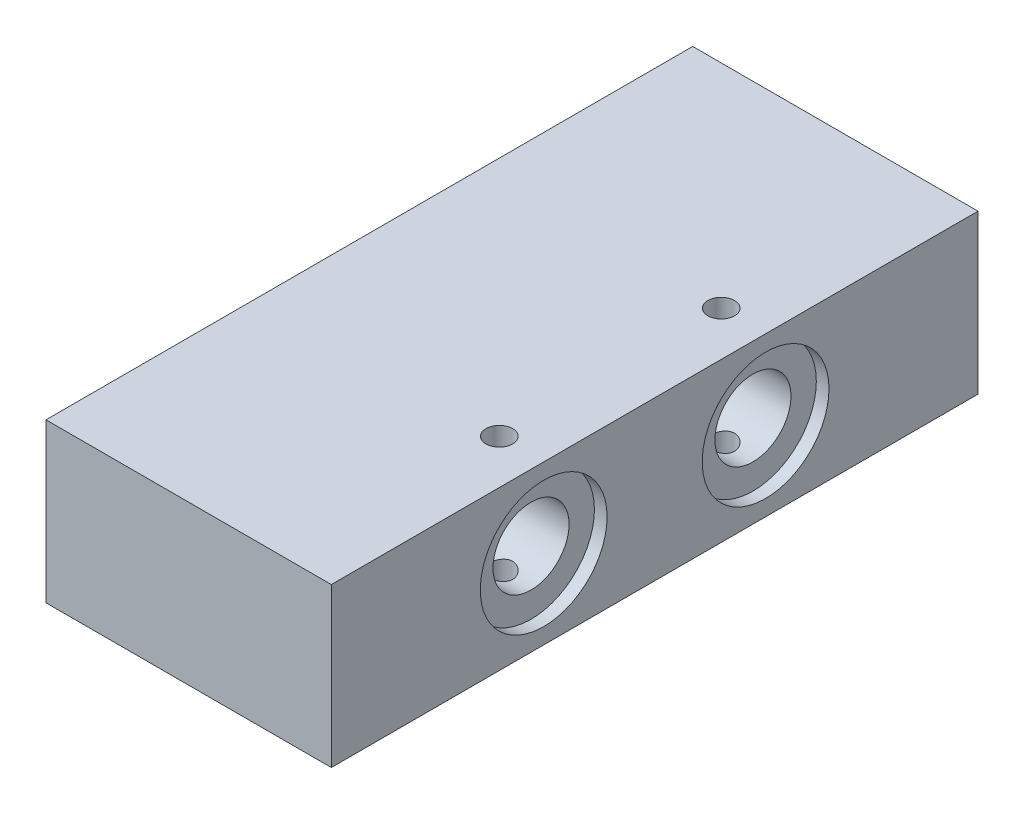
ISO-10303-21;
HEADER;
FILE_DESCRIPTION(('STEP AP214'),'2;1');
FILE_NAME('part.step','',(''),(''),'','','');
FILE_SCHEMA(('AUTOMOTIVE_DESIGN { 1 0 10303 214 1 1 1 1 }'));
ENDSEC;
DATA;
#1=APPLICATION_CONTEXT('core data for automotive mechanical design processes');
#2=APPLICATION_PROTOCOL_DEFINITION('international standard','automotive_design',2000,#1);
#3=PRODUCT_CONTEXT('',#1,'mechanical');
#4=PRODUCT('Part','Part','',(#3));
#5=PRODUCT_RELATED_PRODUCT_CATEGORY('part','',(#4));
#6=PRODUCT_DEFINITION_FORMATION('','',#4);
#7=PRODUCT_DEFINITION_CONTEXT('part definition',#1,'design');
#8=PRODUCT_DEFINITION('design','',#6,#7);
#9=PRODUCT_DEFINITION_SHAPE('','',#8);
#10=(LENGTH_UNIT() NAMED_UNIT(*) SI_UNIT(.MILLI.,.METRE.));
#11=(NAMED_UNIT(*) PLANE_ANGLE_UNIT() SI_UNIT($,.RADIAN.));
#12=(NAMED_UNIT(*) SI_UNIT($,.STERADIAN.) SOLID_ANGLE_UNIT());
#13=UNCERTAINTY_MEASURE_WITH_UNIT(LENGTH_MEASURE(1.E-05),#10,'distance_accuracy_value','');
#14=(GEOMETRIC_REPRESENTATION_CONTEXT(3) GLOBAL_UNCERTAINTY_ASSIGNED_CONTEXT((#13)) GLOBAL_UNIT_ASSIGNED_CONTEXT((#10,
#11,#12)) REPRESENTATION_CONTEXT('',''));
#15=CARTESIAN_POINT('',(0.,0.,0.));
#16=DIRECTION('',(0.,0.,1.));
#17=DIRECTION('',(1.,0.,0.));
#18=AXIS2_PLACEMENT_3D('',#15,#16,#17);
#19=CARTESIAN_POINT('',(51.5,12.5,-17.5));
#20=DIRECTION('',(-1.,0.,0.));
#21=DIRECTION('',(0.,0.,1.));
#22=AXIS2_PLACEMENT_3D('',#19,#20,#21);
#23=CYLINDRICAL_SURFACE('',#22,6.);
#24=CARTESIAN_POINT('',(-20.5,12.5,-17.5));
#25=DIRECTION('',(-1.,0.,0.));
#26=DIRECTION('',(0.,0.,1.));
#27=AXIS2_PLACEMENT_3D('',#24,#25,#26);
#28=CIRCLE('',#27,6.);
#29=CARTESIAN_POINT('',(-20.5,12.5,-11.5));
#30=VERTEX_POINT('',#29);
#31=EDGE_CURVE('E218',#30,#30,#28,.F.);
#32=ORIENTED_EDGE('',*,*,#31,.F.);
#33=EDGE_LOOP('',(#32));
#34=FACE_BOUND('',#33,.T.);
#35=CARTESIAN_POINT('',(15.5,6.87950180144144,-15.4));
#36=CARTESIAN_POINT('',(15.6140091370659,6.87950335416849,-15.3999981660795));
#37=CARTESIAN_POINT('',(15.7280054997691,6.87599503168696,-15.4093155658493));
#38=CARTESIAN_POINT('',(15.9525975361268,6.86242335244124,-15.4461965878829));
#39=CARTESIAN_POINT('',(16.0631929264259,6.85235945103352,-15.4737617261887));
#40=CARTESIAN_POINT('',(16.2776880101657,6.82695321430134,-15.5460324573795));
#41=CARTESIAN_POINT('',(16.381601386583,6.8116221018064,-15.5907016297407));
#42=CARTESIAN_POINT('',(16.5804960604428,6.77742586142541,-15.69578606891));
#43=CARTESIAN_POINT('',(16.6754750785458,6.75855983536296,-15.7562053391467));
#44=CARTESIAN_POINT('',(16.8579071700696,6.71850594504688,-15.8938702362096));
#45=CARTESIAN_POINT('',(16.9449187063024,6.69725602288834,-15.9716830748876));
#46=CARTESIAN_POINT('',(17.10496249642,6.65535047699435,-16.1407185024931));
#47=CARTESIAN_POINT('',(17.177992236625,6.63469496068866,-16.2319434974871));
#48=CARTESIAN_POINT('',(17.310050077352,6.59557966571241,-16.4284898883687));
#49=CARTESIAN_POINT('',(17.3686088540457,6.57720128059706,-16.5341442555558));
#50=CARTESIAN_POINT('',(17.4669437706491,6.54544783853445,-16.7545591394719));
#51=CARTESIAN_POINT('',(17.5067255278447,6.53207128550083,-16.8693169208311));
#52=CARTESIAN_POINT('',(17.5648601464858,6.512268593626,-17.1000466706463));
#53=CARTESIAN_POINT('',(17.5839708470312,6.50559733693646,-17.2158062571395));
#54=CARTESIAN_POINT('',(17.6026377051915,6.49908311029604,-17.4490686387137));
#55=CARTESIAN_POINT('',(17.602199408933,6.49923820368286,-17.5665709299256));
#56=CARTESIAN_POINT('',(17.5822462301927,6.50619701185992,-17.794593124822));
#57=CARTESIAN_POINT('',(17.5635559817971,6.51271331867675,-17.9051954286346));
#58=CARTESIAN_POINT('',(17.5090021832464,6.53129529585531,-18.1215810771555));
#59=CARTESIAN_POINT('',(17.4731374429334,6.54336135080119,-18.22736408734));
#60=CARTESIAN_POINT('',(17.3848104180733,6.57203678183691,-18.4328288990906));
#61=CARTESIAN_POINT('',(17.3321262487989,6.58870646852658,-18.532406550088));
#62=CARTESIAN_POINT('',(17.211843528005,6.62487245537467,-18.721540704408));
#63=CARTESIAN_POINT('',(17.1442405464951,6.64436959452568,-18.8110942192348));
#64=CARTESIAN_POINT('',(16.9919527118636,6.68533926038361,-18.9825279514394));
#65=CARTESIAN_POINT('',(16.9065667789838,6.70686180602603,-19.0637743670444));
#66=CARTESIAN_POINT('',(16.7232176097307,6.7486258207319,-19.2110132703147));
#67=CARTESIAN_POINT('',(16.6252520044331,6.7688670474309,-19.2770028783432));
#68=CARTESIAN_POINT('',(16.4173279585617,6.80606706045124,-19.3928569192318));
#69=CARTESIAN_POINT('',(16.307192826315,6.82296367852674,-19.4424257616536));
#70=CARTESIAN_POINT('',(16.0793951910192,6.85084427406937,-19.5220885446028));
#71=CARTESIAN_POINT('',(15.9617362639265,6.86183103738032,-19.5521916624246));
#72=CARTESIAN_POINT('',(15.7284219502318,6.87600736418172,-19.5907199837269));
#73=CARTESIAN_POINT('',(15.6129521614298,6.87955350700116,-19.6001376236113));
#74=CARTESIAN_POINT('',(15.3820525037002,6.87944898612691,-19.5998594060516));
#75=CARTESIAN_POINT('',(15.2666226314522,6.87579980772447,-19.5901674932892));
#76=CARTESIAN_POINT('',(15.0438091289816,6.86207398681584,-19.5528405037226));
#77=CARTESIAN_POINT('',(14.9362874798439,6.85225503930687,-19.525924056684));
#78=CARTESIAN_POINT('',(14.727318158626,6.82758816412807,-19.4557904123206));
#79=CARTESIAN_POINT('',(14.6258716349547,6.81273928913698,-19.4125701442093));
#80=CARTESIAN_POINT('',(14.4280943334976,6.77906028994252,-19.3093870929003));
#81=CARTESIAN_POINT('',(14.3320558829778,6.76011169196325,-19.2489037417046));
#82=CARTESIAN_POINT('',(14.1511349308617,6.72058587821707,-19.1134870037983));
#83=CARTESIAN_POINT('',(14.066256051002,6.70000813718104,-19.0385489453155));
#84=CARTESIAN_POINT('',(13.9053276287455,6.65820128584423,-18.8715594846913));
#85=CARTESIAN_POINT('',(13.8300006844134,6.63699685862056,-18.7788033309581));
#86=CARTESIAN_POINT('',(13.6959189184049,6.59740776303064,-18.5814435616735));
#87=CARTESIAN_POINT('',(13.6371637117127,6.57902302915819,-18.4768402214503));
#88=CARTESIAN_POINT('',(13.538387443467,6.54720718258133,-18.259129698059));
#89=CARTESIAN_POINT('',(13.4982621738044,6.53374860687456,-18.1460740272197));
#90=CARTESIAN_POINT('',(13.4377846514194,6.5131883790364,-17.9142488500416));
#91=CARTESIAN_POINT('',(13.4174244405947,6.50608416850659,-17.7954816635909));
#92=CARTESIAN_POINT('',(13.3978277524379,6.49924562159753,-17.5621821302514));
#93=CARTESIAN_POINT('',(13.3975585229167,6.49915096949631,-17.4477462191436));
#94=CARTESIAN_POINT('',(13.4155616577485,6.50543479747877,-17.2205349556428));
#95=CARTESIAN_POINT('',(13.4338322495852,6.51181265875197,-17.1077594455513));
#96=CARTESIAN_POINT('',(13.4876928151197,6.53017926099215,-16.8892218163541));
#97=CARTESIAN_POINT('',(13.5229471878998,6.54205911331472,-16.7833671643239));
#98=CARTESIAN_POINT('',(13.6094556259067,6.57020317095777,-16.5790455837162));
#99=CARTESIAN_POINT('',(13.6607126656733,6.5864681913067,-16.4805800328323));
#100=CARTESIAN_POINT('',(13.7800726297771,6.62251806982536,-16.2896196482028));
#101=CARTESIAN_POINT('',(13.848756728594,6.64241583855187,-16.1975097239615));
#102=CARTESIAN_POINT('',(14.0000615993759,6.68325566107431,-16.0257918633522));
#103=CARTESIAN_POINT('',(14.0826870416958,6.7041980631613,-15.9461881338785));
#104=CARTESIAN_POINT('',(14.2639022541288,6.74588527045598,-15.7981342176843));
#105=CARTESIAN_POINT('',(14.3630375996522,6.76658010223277,-15.7303354238279));
#106=CARTESIAN_POINT('',(14.5719486285899,6.8043218636563,-15.6123816880105));
#107=CARTESIAN_POINT('',(14.6817229325817,6.82136926530336,-15.5622244625783));
#108=CARTESIAN_POINT('',(14.9076825781629,6.84947477567238,-15.4817389953169));
#109=CARTESIAN_POINT('',(15.0237833759296,6.86059717380551,-15.4511971362794));
#110=CARTESIAN_POINT('',(15.2599286991957,6.87560824513645,-15.4103331440172));
#111=CARTESIAN_POINT('',(15.3799714290427,6.87950016673379,-15.4000019307475));
#112=CARTESIAN_POINT('',(15.5,6.87950180144144,-15.4));
#113=B_SPLINE_CURVE_WITH_KNOTS('',3,(#35,#36,#37,#38,#39,#40,#41,#42,#43,#44,#45,#46,#47,#48,
#49,#50,#51,#52,#53,#54,#55,#56,#57,#58,#59,#60,#61,#62,#63,#64,#65,#66,#67,#68,#69,#70,#71,#72,
#73,#74,#75,#76,#77,#78,#79,#80,#81,#82,#83,#84,#85,#86,#87,#88,#89,#90,#91,#92,#93,#94,#95,#96,
#97,#98,#99,#100,#101,#102,#103,#104,#105,#106,#107,#108,#109,#110,#111,#112),.UNSPECIFIED.,.T.,
.F.,(4,2,2,2,2,2,2,2,2,2,2,2,2,2,2,2,2,2,2,2,2,2,2,2,2,2,2,2,2,2,2,2,2,2,2,2,2,2,4),(0.,
0.341581962713038,0.683192307989642,1.02407925348461,1.36505293174606,1.71940579240763,
2.07382229975039,2.43855298376331,2.80317448659719,3.15392083853409,3.50456768299669,
3.84007194782349,4.17559946579063,4.51575014165978,4.85600195806706,5.21379905942499,
5.57166363794492,5.93565848344081,6.29948159486754,6.64542887028429,6.99130474115208,
7.32361553252674,7.65598894513419,7.99969400689681,8.34351034108724,8.70586039893278,
9.06820203750371,9.42849171734221,9.78863627174602,10.1302545747611,10.471840220127,
10.806936933281,11.1420959705822,11.4903822545165,11.8387854469785,12.2026433598833,
12.5664541587759,12.9262325794049,13.2858493250833),.UNSPECIFIED.);
#114=CARTESIAN_POINT('',(15.5,6.87950180144144,-15.4));
#115=VERTEX_POINT('',#114);
#116=EDGE_CURVE('E217',#115,#115,#113,.T.);
#117=ORIENTED_EDGE('',*,*,#116,.F.);
#118=EDGE_LOOP('',(#117));
#119=FACE_BOUND('',#118,.T.);
#120=CARTESIAN_POINT('',(15.5,18.1204981985586,-15.4));
#121=CARTESIAN_POINT('',(15.3859908629341,18.1204966458315,-15.3999981660795));
#122=CARTESIAN_POINT('',(15.2719945002309,18.124004968313,-15.4093155658493));
#123=CARTESIAN_POINT('',(15.0474024638732,18.1375766475588,-15.4461965878829));
#124=CARTESIAN_POINT('',(14.9368070735741,18.1476405489665,-15.4737617261887));
#125=CARTESIAN_POINT('',(14.7223119898343,18.1730467856987,-15.5460324573795));
#126=CARTESIAN_POINT('',(14.618398613417,18.1883778981936,-15.5907016297407));
#127=CARTESIAN_POINT('',(14.4195039395572,18.2225741385746,-15.69578606891));
#128=CARTESIAN_POINT('',(14.3245249214541,18.241440164637,-15.7562053391467));
#129=CARTESIAN_POINT('',(14.1420928299304,18.2814940549531,-15.8938702362096));
#130=CARTESIAN_POINT('',(14.0550812936976,18.3027439771117,-15.9716830748876));
#131=CARTESIAN_POINT('',(13.89503750358,18.3446495230056,-16.1407185024931));
#132=CARTESIAN_POINT('',(13.822007763375,18.3653050393113,-16.2319434974871));
#133=CARTESIAN_POINT('',(13.689949922648,18.4044203342876,-16.4284898883687));
#134=CARTESIAN_POINT('',(13.6313911459543,18.4227987194029,-16.5341442555558));
#135=CARTESIAN_POINT('',(13.5330562293509,18.4545521614656,-16.7545591394719));
#136=CARTESIAN_POINT('',(13.4932744721553,18.4679287144992,-16.8693169208311));
#137=CARTESIAN_POINT('',(13.4351398535142,18.487731406374,-17.1000466706463));
#138=CARTESIAN_POINT('',(13.4160291529688,18.4944026630635,-17.2158062571395));
#139=CARTESIAN_POINT('',(13.3973622948085,18.500916889704,-17.4490686387137));
#140=CARTESIAN_POINT('',(13.397800591067,18.5007617963171,-17.5665709299256));
#141=CARTESIAN_POINT('',(13.4177537698073,18.4938029881401,-17.794593124822));
#142=CARTESIAN_POINT('',(13.4364440182029,18.4872866813233,-17.9051954286346));
#143=CARTESIAN_POINT('',(13.4909978167536,18.4687047041447,-18.1215810771555));
#144=CARTESIAN_POINT('',(13.5268625570666,18.4566386491988,-18.22736408734));
#145=CARTESIAN_POINT('',(13.6151895819266,18.4279632181631,-18.4328288990906));
#146=CARTESIAN_POINT('',(13.6678737512011,18.4112935314734,-18.532406550088));
#147=CARTESIAN_POINT('',(13.788156471995,18.3751275446253,-18.721540704408));
#148=CARTESIAN_POINT('',(13.8557594535049,18.3556304054743,-18.8110942192348));
#149=CARTESIAN_POINT('',(14.0080472881364,18.3146607396164,-18.9825279514394));
#150=CARTESIAN_POINT('',(14.0934332210161,18.293138193974,-19.0637743670445));
#151=CARTESIAN_POINT('',(14.2767823902693,18.2513741792681,-19.2110132703147));
#152=CARTESIAN_POINT('',(14.3747479955669,18.2311329525691,-19.2770028783432));
#153=CARTESIAN_POINT('',(14.5826720414383,18.1939329395488,-19.3928569192318));
#154=CARTESIAN_POINT('',(14.692807173685,18.1770363214733,-19.4424257616536));
#155=CARTESIAN_POINT('',(14.9206048089808,18.1491557259306,-19.5220885446028));
#156=CARTESIAN_POINT('',(15.0382637360735,18.1381689626197,-19.5521916624246));
#157=CARTESIAN_POINT('',(15.2715780497682,18.1239926358183,-19.5907199837269));
#158=CARTESIAN_POINT('',(15.3870478385702,18.1204464929988,-19.6001376236113));
#159=CARTESIAN_POINT('',(15.6179474962998,18.1205510138731,-19.5998594060516));
#160=CARTESIAN_POINT('',(15.7333773685477,18.1242001922755,-19.5901674932892));
#161=CARTESIAN_POINT('',(15.9561908710184,18.1379260131842,-19.5528405037226));
#162=CARTESIAN_POINT('',(16.0637125201561,18.1477449606931,-19.525924056684));
#163=CARTESIAN_POINT('',(16.272681841374,18.1724118358719,-19.4557904123206));
#164=CARTESIAN_POINT('',(16.3741283650453,18.187260710863,-19.4125701442093));
#165=CARTESIAN_POINT('',(16.5719056665024,18.2209397100575,-19.3093870929003));
#166=CARTESIAN_POINT('',(16.6679441170222,18.2398883080368,-19.2489037417047));
#167=CARTESIAN_POINT('',(16.8488650691383,18.2794141217829,-19.1134870037983));
#168=CARTESIAN_POINT('',(16.933743948998,18.299991862819,-19.0385489453155));
#169=CARTESIAN_POINT('',(17.0946723712545,18.3417987141558,-18.8715594846913));
#170=CARTESIAN_POINT('',(17.1699993155866,18.3630031413794,-18.7788033309581));
#171=CARTESIAN_POINT('',(17.3040810815951,18.4025922369694,-18.5814435616735));
#172=CARTESIAN_POINT('',(17.3628362882873,18.4209769708418,-18.4768402214503));
#173=CARTESIAN_POINT('',(17.461612556533,18.4527928174187,-18.259129698059));
#174=CARTESIAN_POINT('',(17.5017378261956,18.4662513931254,-18.1460740272197));
#175=CARTESIAN_POINT('',(17.5622153485806,18.4868116209636,-17.9142488500416));
#176=CARTESIAN_POINT('',(17.5825755594053,18.4939158314934,-17.795481663591));
#177=CARTESIAN_POINT('',(17.6021722475621,18.5007543784025,-17.5621821302514));
#178=CARTESIAN_POINT('',(17.6024414770833,18.5008490305037,-17.4477462191436));
#179=CARTESIAN_POINT('',(17.5844383422515,18.4945652025212,-17.2205349556428));
#180=CARTESIAN_POINT('',(17.5661677504148,18.488187341248,-17.1077594455513));
#181=CARTESIAN_POINT('',(17.5123071848803,18.4698207390079,-16.8892218163541));
#182=CARTESIAN_POINT('',(17.4770528121002,18.4579408866853,-16.7833671643239));
#183=CARTESIAN_POINT('',(17.3905443740933,18.4297968290422,-16.5790455837162));
#184=CARTESIAN_POINT('',(17.3392873343267,18.4135318086933,-16.4805800328323));
#185=CARTESIAN_POINT('',(17.2199273702229,18.3774819301746,-16.2896196482028));
#186=CARTESIAN_POINT('',(17.1512432714059,18.3575841614481,-16.1975097239615));
#187=CARTESIAN_POINT('',(16.9999384006241,18.3167443389257,-16.0257918633522));
#188=CARTESIAN_POINT('',(16.9173129583042,18.2958019368387,-15.9461881338785));
#189=CARTESIAN_POINT('',(16.7360977458712,18.254114729544,-15.7981342176843));
#190=CARTESIAN_POINT('',(16.6369624003478,18.2334198977672,-15.7303354238279));
#191=CARTESIAN_POINT('',(16.4280513714101,18.1956781363437,-15.6123816880105));
#192=CARTESIAN_POINT('',(16.3182770674183,18.1786307346966,-15.5622244625783));
#193=CARTESIAN_POINT('',(16.0923174218371,18.1505252243276,-15.4817389953169));
#194=CARTESIAN_POINT('',(15.9762166240704,18.1394028261945,-15.4511971362794));
#195=CARTESIAN_POINT('',(15.7400713008043,18.1243917548636,-15.4103331440172));
#196=CARTESIAN_POINT('',(15.6200285709573,18.1204998332662,-15.4000019307475));
#197=CARTESIAN_POINT('',(15.5,18.1204981985586,-15.4));
#198=B_SPLINE_CURVE_WITH_KNOTS('',3,(#120,#121,#122,#123,#124,#125,#126,#127,#128,#129,#130,
#131,#132,#133,#134,#135,#136,#137,#138,#139,#140,#141,#142,#143,#144,#145,#146,#147,#148,#149,
#150,#151,#152,#153,#154,#155,#156,#157,#158,#159,#160,#161,#162,#163,#164,#165,#166,#167,#168,
#169,#170,#171,#172,#173,#174,#175,#176,#177,#178,#179,#180,#181,#182,#183,#184,#185,#186,#187,
#188,#189,#190,#191,#192,#193,#194,#195,#196,#197),.UNSPECIFIED.,.T.,.F.,(4,2,2,2,2,2,2,2,2,2,2,
2,2,2,2,2,2,2,2,2,2,2,2,2,2,2,2,2,2,2,2,2,2,2,2,2,2,2,4),(0.,0.341581962713036,
0.683192307989641,1.02407925348461,1.36505293174606,1.71940579240762,2.07382229975038,
2.43855298376331,2.80317448659718,3.15392083853409,3.50456768299669,3.84007194782349,
4.17559946579063,4.51575014165978,4.85600195806706,5.21379905942499,5.57166363794492,
5.93565848344081,6.29948159486754,6.64542887028429,6.99130474115207,7.32361553252674,
7.65598894513419,7.9996940068968,8.34351034108723,8.70586039893278,9.0682020375037,
9.4284917173422,9.78863627174602,10.1302545747611,10.471840220127,10.806936933281,
11.1420959705822,11.4903822545165,11.8387854469784,12.2026433598833,12.5664541587759,
12.9262325794049,13.2858493250833),.UNSPECIFIED.);
#199=CARTESIAN_POINT('',(15.5,18.1204981985586,-15.4));
#200=VERTEX_POINT('',#199);
#201=EDGE_CURVE('E208',#200,#200,#198,.T.);
#202=ORIENTED_EDGE('',*,*,#201,.F.);
#203=EDGE_LOOP('',(#202));
#204=FACE_BOUND('',#203,.T.);
#205=CARTESIAN_POINT('',(20.5,12.5,-17.5));
#206=DIRECTION('',(1.,0.,0.));
#207=DIRECTION('',(0.,0.,-1.));
#208=AXIS2_PLACEMENT_3D('',#205,#206,#207);
#209=CIRCLE('',#208,6.);
#210=CARTESIAN_POINT('',(20.5,12.5,-23.5));
#211=VERTEX_POINT('',#210);
#212=EDGE_CURVE('E49',#211,#211,#209,.F.);
#213=ORIENTED_EDGE('',*,*,#212,.F.);
#214=EDGE_LOOP('',(#213));
#215=FACE_BOUND('',#214,.T.);
#216=ADVANCED_FACE('F45',(#34,#119,#204,#215),#23,.F.);
#217=CARTESIAN_POINT('',(51.5,12.5,17.5));
#218=DIRECTION('',(-1.,0.,0.));
#219=DIRECTION('',(0.,0.,1.));
#220=AXIS2_PLACEMENT_3D('',#217,#218,#219);
#221=CYLINDRICAL_SURFACE('',#220,6.);
#222=CARTESIAN_POINT('',(-20.5,12.5,17.5));
#223=DIRECTION('',(-1.,0.,0.));
#224=DIRECTION('',(0.,0.,1.));
#225=AXIS2_PLACEMENT_3D('',#222,#223,#224);
#226=CIRCLE('',#225,6.);
#227=CARTESIAN_POINT('',(-20.5,12.5,23.5));
#228=VERTEX_POINT('',#227);
#229=EDGE_CURVE('E149',#228,#228,#226,.F.);
#230=ORIENTED_EDGE('',*,*,#229,.F.);
#231=EDGE_LOOP('',(#230));
#232=FACE_BOUND('',#231,.T.);
#233=CARTESIAN_POINT('',(15.5,6.87950180144144,19.6));
#234=CARTESIAN_POINT('',(15.6140091370659,6.87950335416849,19.6000018339205));
#235=CARTESIAN_POINT('',(15.7280054997691,6.87599503168696,19.5906844341507));
#236=CARTESIAN_POINT('',(15.9525975361268,6.86242335244124,19.5538034121171));
#237=CARTESIAN_POINT('',(16.0631929264259,6.85235945103352,19.5262382738113));
#238=CARTESIAN_POINT('',(16.2776880101657,6.82695321430134,19.4539675426205));
#239=CARTESIAN_POINT('',(16.381601386583,6.8116221018064,19.4092983702593));
#240=CARTESIAN_POINT('',(16.5804960604428,6.77742586142541,19.30421393109));
#241=CARTESIAN_POINT('',(16.6754750785458,6.75855983536295,19.2437946608533));
#242=CARTESIAN_POINT('',(16.8579071700696,6.71850594504688,19.1061297637904));
#243=CARTESIAN_POINT('',(16.9449187063024,6.69725602288834,19.0283169251124));
#244=CARTESIAN_POINT('',(17.10496249642,6.65535047699435,18.8592814975069));
#245=CARTESIAN_POINT('',(17.177992236625,6.63469496068866,18.7680565025129));
#246=CARTESIAN_POINT('',(17.310050077352,6.59557966571241,18.5715101116313));
#247=CARTESIAN_POINT('',(17.3686088540457,6.57720128059706,18.4658557444442));
#248=CARTESIAN_POINT('',(17.4669437706491,6.54544783853445,18.2454408605281));
#249=CARTESIAN_POINT('',(17.5067255278447,6.53207128550083,18.1306830791689));
#250=CARTESIAN_POINT('',(17.5648601464858,6.512268593626,17.8999533293537));
#251=CARTESIAN_POINT('',(17.5839708470312,6.50559733693646,17.7841937428605));
#252=CARTESIAN_POINT('',(17.6026377051915,6.49908311029604,17.5509313612863));
#253=CARTESIAN_POINT('',(17.602199408933,6.49923820368286,17.4334290700744));
#254=CARTESIAN_POINT('',(17.5822462301927,6.50619701185992,17.205406875178));
#255=CARTESIAN_POINT('',(17.5635559817971,6.51271331867675,17.0948045713654));
#256=CARTESIAN_POINT('',(17.5090021832464,6.53129529585531,16.8784189228445));
#257=CARTESIAN_POINT('',(17.4731374429334,6.54336135080119,16.77263591266));
#258=CARTESIAN_POINT('',(17.3848104180733,6.57203678183691,16.5671711009094));
#259=CARTESIAN_POINT('',(17.3321262487989,6.58870646852658,16.467593449912));
#260=CARTESIAN_POINT('',(17.211843528005,6.62487245537467,16.278459295592));
#261=CARTESIAN_POINT('',(17.1442405464951,6.64436959452568,16.1889057807652));
#262=CARTESIAN_POINT('',(16.9919527118636,6.68533926038361,16.0174720485606));
#263=CARTESIAN_POINT('',(16.9065667789838,6.70686180602603,15.9362256329556));
#264=CARTESIAN_POINT('',(16.7232176097307,6.7486258207319,15.7889867296853));
#265=CARTESIAN_POINT('',(16.6252520044331,6.7688670474309,15.7229971216568));
#266=CARTESIAN_POINT('',(16.4173279585617,6.80606706045124,15.6071430807682));
#267=CARTESIAN_POINT('',(16.307192826315,6.82296367852674,15.5575742383464));
#268=CARTESIAN_POINT('',(16.0793951910192,6.85084427406937,15.4779114553972));
#269=CARTESIAN_POINT('',(15.9617362639265,6.86183103738032,15.4478083375754));
#270=CARTESIAN_POINT('',(15.7284219502318,6.87600736418172,15.4092800162731));
#271=CARTESIAN_POINT('',(15.6129521614298,6.87955350700116,15.3998623763887));
#272=CARTESIAN_POINT('',(15.3820525037002,6.87944898612692,15.4001405939484));
#273=CARTESIAN_POINT('',(15.2666226314522,6.87579980772447,15.4098325067108));
#274=CARTESIAN_POINT('',(15.0438091289816,6.86207398681584,15.4471594962774));
#275=CARTESIAN_POINT('',(14.9362874798439,6.85225503930687,15.474075943316));
#276=CARTESIAN_POINT('',(14.727318158626,6.82758816412807,15.5442095876794));
#277=CARTESIAN_POINT('',(14.6258716349547,6.81273928913698,15.5874298557907));
#278=CARTESIAN_POINT('',(14.4280943334976,6.77906028994252,15.6906129070997));
#279=CARTESIAN_POINT('',(14.3320558829778,6.76011169196325,15.7510962582954));
#280=CARTESIAN_POINT('',(14.1511349308617,6.72058587821707,15.8865129962017));
#281=CARTESIAN_POINT('',(14.066256051002,6.70000813718104,15.9614510546845));
#282=CARTESIAN_POINT('',(13.9053276287455,6.65820128584423,16.1284405153087));
#283=CARTESIAN_POINT('',(13.8300006844134,6.63699685862056,16.2211966690419));
#284=CARTESIAN_POINT('',(13.6959189184049,6.59740776303064,16.4185564383265));
#285=CARTESIAN_POINT('',(13.6371637117127,6.57902302915819,16.5231597785497));
#286=CARTESIAN_POINT('',(13.538387443467,6.54720718258133,16.740870301941));
#287=CARTESIAN_POINT('',(13.4982621738044,6.53374860687456,16.8539259727803));
#288=CARTESIAN_POINT('',(13.4377846514194,6.5131883790364,17.0857511499584));
#289=CARTESIAN_POINT('',(13.4174244405947,6.50608416850659,17.2045183364091));
#290=CARTESIAN_POINT('',(13.3978277524379,6.49924562159753,17.4378178697486));
#291=CARTESIAN_POINT('',(13.3975585229167,6.49915096949631,17.5522537808564));
#292=CARTESIAN_POINT('',(13.4155616577485,6.50543479747877,17.7794650443572));
#293=CARTESIAN_POINT('',(13.4338322495852,6.51181265875197,17.8922405544487));
#294=CARTESIAN_POINT('',(13.4876928151197,6.53017926099215,18.1107781836459));
#295=CARTESIAN_POINT('',(13.5229471878998,6.54205911331472,18.2166328356761));
#296=CARTESIAN_POINT('',(13.6094556259067,6.57020317095777,18.4209544162838));
#297=CARTESIAN_POINT('',(13.6607126656733,6.5864681913067,18.5194199671677));
#298=CARTESIAN_POINT('',(13.7800726297771,6.62251806982536,18.7103803517972));
#299=CARTESIAN_POINT('',(13.848756728594,6.64241583855187,18.8024902760385));
#300=CARTESIAN_POINT('',(14.0000615993759,6.68325566107431,18.9742081366478));
#301=CARTESIAN_POINT('',(14.0826870416958,6.7041980631613,19.0538118661215));
#302=CARTESIAN_POINT('',(14.2639022541288,6.74588527045598,19.2018657823157));
#303=CARTESIAN_POINT('',(14.3630375996522,6.76658010223277,19.2696645761721));
#304=CARTESIAN_POINT('',(14.5719486285899,6.8043218636563,19.3876183119895));
#305=CARTESIAN_POINT('',(14.6817229325817,6.82136926530336,19.4377755374217));
#306=CARTESIAN_POINT('',(14.9076825781629,6.84947477567238,19.5182610046831));
#307=CARTESIAN_POINT('',(15.0237833759296,6.86059717380551,19.5488028637206));
#308=CARTESIAN_POINT('',(15.2599286991957,6.87560824513645,19.5896668559828));
#309=CARTESIAN_POINT('',(15.3799714290427,6.87950016673379,19.5999980692525));
#310=CARTESIAN_POINT('',(15.5,6.87950180144144,19.6));
#311=B_SPLINE_CURVE_WITH_KNOTS('',3,(#233,#234,#235,#236,#237,#238,#239,#240,#241,#242,#243,
#244,#245,#246,#247,#248,#249,#250,#251,#252,#253,#254,#255,#256,#257,#258,#259,#260,#261,#262,
#263,#264,#265,#266,#267,#268,#269,#270,#271,#272,#273,#274,#275,#276,#277,#278,#279,#280,#281,
#282,#283,#284,#285,#286,#287,#288,#289,#290,#291,#292,#293,#294,#295,#296,#297,#298,#299,#300,
#301,#302,#303,#304,#305,#306,#307,#308,#309,#310),.UNSPECIFIED.,.T.,.F.,(4,2,2,2,2,2,2,2,2,2,2,
2,2,2,2,2,2,2,2,2,2,2,2,2,2,2,2,2,2,2,2,2,2,2,2,2,2,2,4),(0.,0.341581962713038,
0.683192307989642,1.02407925348462,1.36505293174606,1.71940579240763,2.07382229975039,
2.43855298376331,2.80317448659719,3.15392083853409,3.50456768299669,3.8400719478235,
4.17559946579063,4.51575014165978,4.85600195806706,5.21379905942499,5.57166363794492,
5.93565848344082,6.29948159486754,6.64542887028429,6.99130474115208,7.32361553252674,
7.65598894513419,7.9996940068968,8.34351034108724,8.70586039893278,9.06820203750371,
9.42849171734221,9.78863627174602,10.1302545747611,10.471840220127,10.806936933281,
11.1420959705822,11.4903822545165,11.8387854469785,12.2026433598833,12.5664541587759,
12.9262325794049,13.2858493250833),.UNSPECIFIED.);
#312=CARTESIAN_POINT('',(15.5,6.87950180144144,19.6));
#313=VERTEX_POINT('',#312);
#314=EDGE_CURVE('E167',#313,#313,#311,.T.);
#315=ORIENTED_EDGE('',*,*,#314,.F.);
#316=EDGE_LOOP('',(#315));
#317=FACE_BOUND('',#316,.T.);
#318=CARTESIAN_POINT('',(15.5,18.1204981985586,19.6));
#319=CARTESIAN_POINT('',(15.3859908629341,18.1204966458315,19.6000018339205));
#320=CARTESIAN_POINT('',(15.2719945002309,18.124004968313,19.5906844341507));
#321=CARTESIAN_POINT('',(15.0474024638732,18.1375766475588,19.5538034121171));
#322=CARTESIAN_POINT('',(14.9368070735741,18.1476405489665,19.5262382738113));
#323=CARTESIAN_POINT('',(14.7223119898343,18.1730467856987,19.4539675426205));
#324=CARTESIAN_POINT('',(14.618398613417,18.1883778981936,19.4092983702593));
#325=CARTESIAN_POINT('',(14.4195039395572,18.2225741385746,19.30421393109));
#326=CARTESIAN_POINT('',(14.3245249214541,18.241440164637,19.2437946608533));
#327=CARTESIAN_POINT('',(14.1420928299304,18.2814940549531,19.1061297637904));
#328=CARTESIAN_POINT('',(14.0550812936976,18.3027439771117,19.0283169251124));
#329=CARTESIAN_POINT('',(13.89503750358,18.3446495230056,18.8592814975069));
#330=CARTESIAN_POINT('',(13.822007763375,18.3653050393113,18.7680565025129));
#331=CARTESIAN_POINT('',(13.689949922648,18.4044203342876,18.5715101116313));
#332=CARTESIAN_POINT('',(13.6313911459543,18.4227987194029,18.4658557444442));
#333=CARTESIAN_POINT('',(13.5330562293509,18.4545521614656,18.2454408605281));
#334=CARTESIAN_POINT('',(13.4932744721553,18.4679287144992,18.1306830791689));
#335=CARTESIAN_POINT('',(13.4351398535142,18.487731406374,17.8999533293537));
#336=CARTESIAN_POINT('',(13.4160291529688,18.4944026630635,17.7841937428605));
#337=CARTESIAN_POINT('',(13.3973622948085,18.500916889704,17.5509313612863));
#338=CARTESIAN_POINT('',(13.397800591067,18.5007617963171,17.4334290700744));
#339=CARTESIAN_POINT('',(13.4177537698073,18.4938029881401,17.205406875178));
#340=CARTESIAN_POINT('',(13.4364440182029,18.4872866813233,17.0948045713654));
#341=CARTESIAN_POINT('',(13.4909978167536,18.4687047041447,16.8784189228445));
#342=CARTESIAN_POINT('',(13.5268625570666,18.4566386491988,16.77263591266));
#343=CARTESIAN_POINT('',(13.6151895819266,18.4279632181631,16.5671711009094));
#344=CARTESIAN_POINT('',(13.6678737512011,18.4112935314734,16.467593449912));
#345=CARTESIAN_POINT('',(13.788156471995,18.3751275446253,16.278459295592));
#346=CARTESIAN_POINT('',(13.8557594535049,18.3556304054743,16.1889057807652));
#347=CARTESIAN_POINT('',(14.0080472881364,18.3146607396164,16.0174720485606));
#348=CARTESIAN_POINT('',(14.0934332210161,18.293138193974,15.9362256329556));
#349=CARTESIAN_POINT('',(14.2767823902693,18.2513741792681,15.7889867296853));
#350=CARTESIAN_POINT('',(14.3747479955669,18.2311329525691,15.7229971216568));
#351=CARTESIAN_POINT('',(14.5826720414383,18.1939329395488,15.6071430807682));
#352=CARTESIAN_POINT('',(14.692807173685,18.1770363214733,15.5575742383464));
#353=CARTESIAN_POINT('',(14.9206048089808,18.1491557259306,15.4779114553972));
#354=CARTESIAN_POINT('',(15.0382637360735,18.1381689626197,15.4478083375754));
#355=CARTESIAN_POINT('',(15.2715780497682,18.1239926358183,15.4092800162731));
#356=CARTESIAN_POINT('',(15.3870478385702,18.1204464929988,15.3998623763887));
#357=CARTESIAN_POINT('',(15.6179474962998,18.1205510138731,15.4001405939484));
#358=CARTESIAN_POINT('',(15.7333773685477,18.1242001922755,15.4098325067108));
#359=CARTESIAN_POINT('',(15.9561908710184,18.1379260131842,15.4471594962774));
#360=CARTESIAN_POINT('',(16.0637125201561,18.1477449606931,15.474075943316));
#361=CARTESIAN_POINT('',(16.272681841374,18.1724118358719,15.5442095876794));
#362=CARTESIAN_POINT('',(16.3741283650453,18.187260710863,15.5874298557907));
#363=CARTESIAN_POINT('',(16.5719056665024,18.2209397100575,15.6906129070997));
#364=CARTESIAN_POINT('',(16.6679441170222,18.2398883080368,15.7510962582954));
#365=CARTESIAN_POINT('',(16.8488650691383,18.2794141217829,15.8865129962017));
#366=CARTESIAN_POINT('',(16.933743948998,18.299991862819,15.9614510546845));
#367=CARTESIAN_POINT('',(17.0946723712545,18.3417987141558,16.1284405153087));
#368=CARTESIAN_POINT('',(17.1699993155866,18.3630031413794,16.2211966690419));
#369=CARTESIAN_POINT('',(17.3040810815951,18.4025922369694,16.4185564383265));
#370=CARTESIAN_POINT('',(17.3628362882873,18.4209769708418,16.5231597785497));
#371=CARTESIAN_POINT('',(17.461612556533,18.4527928174187,16.740870301941));
#372=CARTESIAN_POINT('',(17.5017378261956,18.4662513931254,16.8539259727803));
#373=CARTESIAN_POINT('',(17.5622153485806,18.4868116209636,17.0857511499584));
#374=CARTESIAN_POINT('',(17.5825755594053,18.4939158314934,17.2045183364091));
#375=CARTESIAN_POINT('',(17.6021722475621,18.5007543784025,17.4378178697486));
#376=CARTESIAN_POINT('',(17.6024414770833,18.5008490305037,17.5522537808564));
#377=CARTESIAN_POINT('',(17.5844383422515,18.4945652025212,17.7794650443572));
#378=CARTESIAN_POINT('',(17.5661677504148,18.488187341248,17.8922405544487));
#379=CARTESIAN_POINT('',(17.5123071848803,18.4698207390079,18.1107781836459));
#380=CARTESIAN_POINT('',(17.4770528121002,18.4579408866853,18.2166328356762));
#381=CARTESIAN_POINT('',(17.3905443740933,18.4297968290422,18.4209544162838));
#382=CARTESIAN_POINT('',(17.3392873343267,18.4135318086933,18.5194199671677));
#383=CARTESIAN_POINT('',(17.2199273702229,18.3774819301746,18.7103803517972));
#384=CARTESIAN_POINT('',(17.1512432714059,18.3575841614481,18.8024902760385));
#385=CARTESIAN_POINT('',(16.9999384006241,18.3167443389257,18.9742081366478));
#386=CARTESIAN_POINT('',(16.9173129583042,18.2958019368387,19.0538118661215));
#387=CARTESIAN_POINT('',(16.7360977458712,18.254114729544,19.2018657823157));
#388=CARTESIAN_POINT('',(16.6369624003478,18.2334198977672,19.2696645761721));
#389=CARTESIAN_POINT('',(16.4280513714101,18.1956781363437,19.3876183119895));
#390=CARTESIAN_POINT('',(16.3182770674183,18.1786307346966,19.4377755374217));
#391=CARTESIAN_POINT('',(16.0923174218371,18.1505252243276,19.5182610046831));
#392=CARTESIAN_POINT('',(15.9762166240704,18.1394028261945,19.5488028637206));
#393=CARTESIAN_POINT('',(15.7400713008043,18.1243917548636,19.5896668559828));
#394=CARTESIAN_POINT('',(15.6200285709573,18.1204998332662,19.5999980692525));
#395=CARTESIAN_POINT('',(15.5,18.1204981985586,19.6));
#396=B_SPLINE_CURVE_WITH_KNOTS('',3,(#318,#319,#320,#321,#322,#323,#324,#325,#326,#327,#328,
#329,#330,#331,#332,#333,#334,#335,#336,#337,#338,#339,#340,#341,#342,#343,#344,#345,#346,#347,
#348,#349,#350,#351,#352,#353,#354,#355,#356,#357,#358,#359,#360,#361,#362,#363,#364,#365,#366,
#367,#368,#369,#370,#371,#372,#373,#374,#375,#376,#377,#378,#379,#380,#381,#382,#383,#384,#385,
#386,#387,#388,#389,#390,#391,#392,#393,#394,#395),.UNSPECIFIED.,.T.,.F.,(4,2,2,2,2,2,2,2,2,2,2,
2,2,2,2,2,2,2,2,2,2,2,2,2,2,2,2,2,2,2,2,2,2,2,2,2,2,2,4),(0.,0.341581962713036,
0.683192307989641,1.02407925348461,1.36505293174606,1.71940579240762,2.07382229975038,
2.43855298376331,2.80317448659718,3.15392083853409,3.50456768299669,3.8400719478235,
4.17559946579063,4.51575014165978,4.85600195806706,5.21379905942499,5.57166363794492,
5.93565848344081,6.29948159486754,6.64542887028429,6.99130474115207,7.32361553252674,
7.65598894513419,7.9996940068968,8.34351034108723,8.70586039893277,9.0682020375037,
9.4284917173422,9.78863627174602,10.1302545747611,10.471840220127,10.806936933281,
11.1420959705822,11.4903822545165,11.8387854469785,12.2026433598833,12.5664541587759,
12.9262325794049,13.2858493250833),.UNSPECIFIED.);
#397=CARTESIAN_POINT('',(15.5,18.1204981985586,19.6));
#398=VERTEX_POINT('',#397);
#399=EDGE_CURVE('E240',#398,#398,#396,.T.);
#400=ORIENTED_EDGE('',*,*,#399,.F.);
#401=EDGE_LOOP('',(#400));
#402=FACE_BOUND('',#401,.T.);
#403=CARTESIAN_POINT('',(20.5,12.5,17.5));
#404=DIRECTION('',(1.,0.,0.));
#405=DIRECTION('',(0.,0.,-1.));
#406=AXIS2_PLACEMENT_3D('',#403,#404,#405);
#407=CIRCLE('',#406,6.);
#408=CARTESIAN_POINT('',(20.5,12.5,11.5));
#409=VERTEX_POINT('',#408);
#410=EDGE_CURVE('E133',#409,#409,#407,.F.);
#411=ORIENTED_EDGE('',*,*,#410,.F.);
#412=EDGE_LOOP('',(#411));
#413=FACE_BOUND('',#412,.T.);
#414=ADVANCED_FACE('F230',(#232,#317,#402,#413),#221,.F.);
#415=CARTESIAN_POINT('',(15.5,25.,17.5));
#416=DIRECTION('',(0.,1.,0.));
#417=DIRECTION('',(0.,0.,1.));
#418=AXIS2_PLACEMENT_3D('',#415,#416,#417);
#419=CYLINDRICAL_SURFACE('',#418,2.09999999999999);
#420=ORIENTED_EDGE('',*,*,#314,.T.);
#421=EDGE_LOOP('',(#420));
#422=FACE_BOUND('',#421,.T.);
#423=CARTESIAN_POINT('',(15.5,0.,17.5));
#424=DIRECTION('',(0.,1.,0.));
#425=DIRECTION('',(0.,0.,1.));
#426=AXIS2_PLACEMENT_3D('',#423,#424,#425);
#427=CIRCLE('',#426,2.09999999999999);
#428=CARTESIAN_POINT('',(15.5,0.,19.6));
#429=VERTEX_POINT('',#428);
#430=EDGE_CURVE('E175',#429,#429,#427,.T.);
#431=ORIENTED_EDGE('',*,*,#430,.F.);
#432=EDGE_LOOP('',(#431));
#433=FACE_BOUND('',#432,.T.);
#434=ADVANCED_FACE('F237',(#422,#433),#419,.F.);
#435=CARTESIAN_POINT('',(15.5,25.,-17.5));
#436=DIRECTION('',(0.,1.,0.));
#437=DIRECTION('',(0.,0.,1.));
#438=AXIS2_PLACEMENT_3D('',#435,#436,#437);
#439=CYLINDRICAL_SURFACE('',#438,2.09999999999999);
#440=ORIENTED_EDGE('',*,*,#116,.T.);
#441=EDGE_LOOP('',(#440));
#442=FACE_BOUND('',#441,.T.);
#443=CARTESIAN_POINT('',(15.5,0.,-17.5));
#444=DIRECTION('',(0.,1.,0.));
#445=DIRECTION('',(0.,0.,1.));
#446=AXIS2_PLACEMENT_3D('',#443,#444,#445);
#447=CIRCLE('',#446,2.09999999999999);
#448=CARTESIAN_POINT('',(15.5,0.,-15.4));
#449=VERTEX_POINT('',#448);
#450=EDGE_CURVE('E166',#449,#449,#447,.T.);
#451=ORIENTED_EDGE('',*,*,#450,.F.);
#452=EDGE_LOOP('',(#451));
#453=FACE_BOUND('',#452,.T.);
#454=ADVANCED_FACE('F278',(#442,#453),#439,.F.);
#455=CARTESIAN_POINT('',(22.5,25.,51.));
#456=DIRECTION('',(-1.,0.,0.));
#457=DIRECTION('',(0.,0.,1.));
#458=AXIS2_PLACEMENT_3D('',#455,#456,#457);
#459=PLANE('',#458);
#460=CARTESIAN_POINT('',(22.5,12.5,17.5));
#461=DIRECTION('',(1.,0.,0.));
#462=DIRECTION('',(0.,0.,-1.));
#463=AXIS2_PLACEMENT_3D('',#460,#461,#462);
#464=CIRCLE('',#463,10.);
#465=CARTESIAN_POINT('',(22.5,12.5,7.49999999999999));
#466=VERTEX_POINT('',#465);
#467=EDGE_CURVE('E134',#466,#466,#464,.T.);
#468=ORIENTED_EDGE('',*,*,#467,.F.);
#469=EDGE_LOOP('',(#468));
#470=FACE_BOUND('',#469,.T.);
#471=CARTESIAN_POINT('',(22.5,12.5,-17.5));
#472=DIRECTION('',(1.,0.,0.));
#473=DIRECTION('',(0.,0.,-1.));
#474=AXIS2_PLACEMENT_3D('',#471,#472,#473);
#475=CIRCLE('',#474,10.);
#476=CARTESIAN_POINT('',(22.5,12.5,-27.5));
#477=VERTEX_POINT('',#476);
#478=EDGE_CURVE('E128',#477,#477,#475,.T.);
#479=ORIENTED_EDGE('',*,*,#478,.F.);
#480=EDGE_LOOP('',(#479));
#481=FACE_BOUND('',#480,.T.);
#482=DIRECTION('',(0.,0.,-1.));
#483=VECTOR('',#482,1.);
#484=CARTESIAN_POINT('',(22.5,0.,51.));
#485=LINE('',#484,#483);
#486=CARTESIAN_POINT('',(22.5,0.,51.));
#487=VERTEX_POINT('',#486);
#488=CARTESIAN_POINT('',(22.5,0.,-51.));
#489=VERTEX_POINT('',#488);
#490=EDGE_CURVE('E179',#487,#489,#485,.T.);
#491=ORIENTED_EDGE('',*,*,#490,.T.);
#492=DIRECTION('',(0.,-1.,0.));
#493=VECTOR('',#492,1.);
#494=CARTESIAN_POINT('',(22.5,25.,-51.));
#495=LINE('',#494,#493);
#496=CARTESIAN_POINT('',(22.5,25.,-51.));
#497=VERTEX_POINT('',#496);
#498=EDGE_CURVE('E11',#497,#489,#495,.T.);
#499=ORIENTED_EDGE('',*,*,#498,.F.);
#500=DIRECTION('',(0.,0.,-1.));
#501=VECTOR('',#500,1.);
#502=CARTESIAN_POINT('',(22.5,25.,51.));
#503=LINE('',#502,#501);
#504=CARTESIAN_POINT('',(22.5,25.,51.));
#505=VERTEX_POINT('',#504);
#506=EDGE_CURVE('E180',#505,#497,#503,.T.);
#507=ORIENTED_EDGE('',*,*,#506,.F.);
#508=DIRECTION('',(0.,-1.,0.));
#509=VECTOR('',#508,1.);
#510=CARTESIAN_POINT('',(22.5,25.,51.));
#511=LINE('',#510,#509);
#512=EDGE_CURVE('E190',#505,#487,#511,.T.);
#513=ORIENTED_EDGE('',*,*,#512,.T.);
#514=EDGE_LOOP('',(#491,#499,#507,#513));
#515=FACE_BOUND('',#514,.T.);
#516=ADVANCED_FACE('F47',(#470,#481,#515),#459,.F.);
#517=CARTESIAN_POINT('',(-22.5,25.,-51.));
#518=DIRECTION('',(0.,0.,1.));
#519=DIRECTION('',(1.,0.,0.));
#520=AXIS2_PLACEMENT_3D('',#517,#518,#519);
#521=PLANE('',#520);
#522=CARTESIAN_POINT('',(18.,5.,-51.));
#523=DIRECTION('',(0.,0.,-1.));
#524=DIRECTION('',(-1.,0.,0.));
#525=AXIS2_PLACEMENT_3D('',#522,#523,#524);
#526=CIRCLE('',#525,2.1);
#527=CARTESIAN_POINT('',(15.9,5.,-51.));
#528=VERTEX_POINT('',#527);
#529=EDGE_CURVE('E115',#528,#528,#526,.T.);
#530=ORIENTED_EDGE('',*,*,#529,.F.);
#531=EDGE_LOOP('',(#530));
#532=FACE_BOUND('',#531,.T.);
#533=CARTESIAN_POINT('',(-18.,20.,-51.));
#534=DIRECTION('',(0.,0.,-1.));
#535=DIRECTION('',(-1.,0.,0.));
#536=AXIS2_PLACEMENT_3D('',#533,#534,#535);
#537=CIRCLE('',#536,2.1);
#538=CARTESIAN_POINT('',(-20.1,20.,-51.));
#539=VERTEX_POINT('',#538);
#540=EDGE_CURVE('E114',#539,#539,#537,.T.);
#541=ORIENTED_EDGE('',*,*,#540,.F.);
#542=EDGE_LOOP('',(#541));
#543=FACE_BOUND('',#542,.T.);
#544=DIRECTION('',(-1.,0.,0.));
#545=VECTOR('',#544,1.);
#546=CARTESIAN_POINT('',(-22.5,0.,-51.));
#547=LINE('',#546,#545);
#548=CARTESIAN_POINT('',(-22.5,0.,-51.));
#549=VERTEX_POINT('',#548);
#550=EDGE_CURVE('E194',#489,#549,#547,.T.);
#551=ORIENTED_EDGE('',*,*,#550,.T.);
#552=DIRECTION('',(0.,-1.,0.));
#553=VECTOR('',#552,1.);
#554=CARTESIAN_POINT('',(-22.5,25.,-51.));
#555=LINE('',#554,#553);
#556=CARTESIAN_POINT('',(-22.5,25.,-51.));
#557=VERTEX_POINT('',#556);
#558=EDGE_CURVE('E56',#557,#549,#555,.T.);
#559=ORIENTED_EDGE('',*,*,#558,.F.);
#560=DIRECTION('',(-1.,0.,0.));
#561=VECTOR('',#560,1.);
#562=CARTESIAN_POINT('',(-22.5,25.,-51.));
#563=LINE('',#562,#561);
#564=EDGE_CURVE('E96',#497,#557,#563,.T.);
#565=ORIENTED_EDGE('',*,*,#564,.F.);
#566=ORIENTED_EDGE('',*,*,#498,.T.);
#567=EDGE_LOOP('',(#551,#559,#565,#566));
#568=FACE_BOUND('',#567,.T.);
#569=ADVANCED_FACE('F271',(#532,#543,#568),#521,.F.);
#570=CARTESIAN_POINT('',(-22.5,25.,51.));
#571=DIRECTION('',(1.,0.,0.));
#572=DIRECTION('',(0.,0.,-1.));
#573=AXIS2_PLACEMENT_3D('',#570,#571,#572);
#574=PLANE('',#573);
#575=CARTESIAN_POINT('',(-22.5,12.5,-17.5));
#576=DIRECTION('',(-1.,0.,0.));
#577=DIRECTION('',(0.,0.,1.));
#578=AXIS2_PLACEMENT_3D('',#575,#576,#577);
#579=CIRCLE('',#578,10.);
#580=CARTESIAN_POINT('',(-22.5,12.5,-7.50000000000001));
#581=VERTEX_POINT('',#580);
#582=EDGE_CURVE('E150',#581,#581,#579,.T.);
#583=ORIENTED_EDGE('',*,*,#582,.F.);
#584=EDGE_LOOP('',(#583));
#585=FACE_BOUND('',#584,.T.);
#586=CARTESIAN_POINT('',(-22.5,12.5,17.5));
#587=DIRECTION('',(-1.,0.,0.));
#588=DIRECTION('',(0.,0.,1.));
#589=AXIS2_PLACEMENT_3D('',#586,#587,#588);
#590=CIRCLE('',#589,10.);
#591=CARTESIAN_POINT('',(-22.5,12.5,27.5));
#592=VERTEX_POINT('',#591);
#593=EDGE_CURVE('E158',#592,#592,#590,.T.);
#594=ORIENTED_EDGE('',*,*,#593,.F.);
#595=EDGE_LOOP('',(#594));
#596=FACE_BOUND('',#595,.T.);
#597=DIRECTION('',(0.,0.,1.));
#598=VECTOR('',#597,1.);
#599=CARTESIAN_POINT('',(-22.5,0.,51.));
#600=LINE('',#599,#598);
#601=CARTESIAN_POINT('',(-22.5,0.,51.));
#602=VERTEX_POINT('',#601);
#603=EDGE_CURVE('E83',#549,#602,#600,.T.);
#604=ORIENTED_EDGE('',*,*,#603,.T.);
#605=DIRECTION('',(0.,-1.,0.));
#606=VECTOR('',#605,1.);
#607=CARTESIAN_POINT('',(-22.5,25.,51.));
#608=LINE('',#607,#606);
#609=CARTESIAN_POINT('',(-22.5,25.,51.));
#610=VERTEX_POINT('',#609);
#611=EDGE_CURVE('E203',#610,#602,#608,.T.);
#612=ORIENTED_EDGE('',*,*,#611,.F.);
#613=DIRECTION('',(0.,0.,1.));
#614=VECTOR('',#613,1.);
#615=CARTESIAN_POINT('',(-22.5,25.,51.));
#616=LINE('',#615,#614);
#617=EDGE_CURVE('E185',#557,#610,#616,.T.);
#618=ORIENTED_EDGE('',*,*,#617,.F.);
#619=ORIENTED_EDGE('',*,*,#558,.T.);
#620=EDGE_LOOP('',(#604,#612,#618,#619));
#621=FACE_BOUND('',#620,.T.);
#622=ADVANCED_FACE('F269',(#585,#596,#621),#574,.F.);
#623=CARTESIAN_POINT('',(-22.5,25.,51.));
#624=DIRECTION('',(0.,0.,-1.));
#625=DIRECTION('',(-1.,0.,0.));
#626=AXIS2_PLACEMENT_3D('',#623,#624,#625);
#627=PLANE('',#626);
#628=DIRECTION('',(1.,0.,0.));
#629=VECTOR('',#628,1.);
#630=CARTESIAN_POINT('',(-22.5,0.,51.));
#631=LINE('',#630,#629);
#632=EDGE_CURVE('E89',#602,#487,#631,.T.);
#633=ORIENTED_EDGE('',*,*,#632,.T.);
#634=ORIENTED_EDGE('',*,*,#512,.F.);
#635=DIRECTION('',(1.,0.,0.));
#636=VECTOR('',#635,1.);
#637=CARTESIAN_POINT('',(-22.5,25.,51.));
#638=LINE('',#637,#636);
#639=EDGE_CURVE('E65',#610,#505,#638,.T.);
#640=ORIENTED_EDGE('',*,*,#639,.F.);
#641=ORIENTED_EDGE('',*,*,#611,.T.);
#642=EDGE_LOOP('',(#633,#634,#640,#641));
#643=FACE_BOUND('',#642,.T.);
#644=ADVANCED_FACE('F262',(#643),#627,.F.);
#645=CARTESIAN_POINT('',(0.,25.,0.));
#646=DIRECTION('',(0.,-1.,0.));
#647=DIRECTION('',(0.,0.,-1.));
#648=AXIS2_PLACEMENT_3D('',#645,#646,#647);
#649=PLANE('',#648);
#650=CARTESIAN_POINT('',(15.5,25.,-17.5));
#651=DIRECTION('',(0.,1.,0.));
#652=DIRECTION('',(0.,0.,1.));
#653=AXIS2_PLACEMENT_3D('',#650,#651,#652);
#654=CIRCLE('',#653,2.09999999999999);
#655=CARTESIAN_POINT('',(15.5,25.,-15.4));
#656=VERTEX_POINT('',#655);
#657=EDGE_CURVE('E162',#656,#656,#654,.T.);
#658=ORIENTED_EDGE('',*,*,#657,.F.);
#659=EDGE_LOOP('',(#658));
#660=FACE_BOUND('',#659,.T.);
#661=CARTESIAN_POINT('',(15.5,25.,17.5));
#662=DIRECTION('',(0.,1.,0.));
#663=DIRECTION('',(0.,0.,1.));
#664=AXIS2_PLACEMENT_3D('',#661,#662,#663);
#665=CIRCLE('',#664,2.09999999999999);
#666=CARTESIAN_POINT('',(15.5,25.,19.6));
#667=VERTEX_POINT('',#666);
#668=EDGE_CURVE('E171',#667,#667,#665,.T.);
#669=ORIENTED_EDGE('',*,*,#668,.F.);
#670=EDGE_LOOP('',(#669));
#671=FACE_BOUND('',#670,.T.);
#672=ORIENTED_EDGE('',*,*,#506,.T.);
#673=ORIENTED_EDGE('',*,*,#564,.T.);
#674=ORIENTED_EDGE('',*,*,#617,.T.);
#675=ORIENTED_EDGE('',*,*,#639,.T.);
#676=EDGE_LOOP('',(#672,#673,#674,#675));
#677=FACE_BOUND('',#676,.T.);
#678=ADVANCED_FACE('F258',(#660,#671,#677),#649,.F.);
#679=CARTESIAN_POINT('',(0.,0.,0.));
#680=DIRECTION('',(0.,-1.,0.));
#681=DIRECTION('',(0.,0.,-1.));
#682=AXIS2_PLACEMENT_3D('',#679,#680,#681);
#683=PLANE('',#682);
#684=ORIENTED_EDGE('',*,*,#450,.T.);
#685=EDGE_LOOP('',(#684));
#686=FACE_BOUND('',#685,.T.);
#687=ORIENTED_EDGE('',*,*,#430,.T.);
#688=EDGE_LOOP('',(#687));
#689=FACE_BOUND('',#688,.T.);
#690=ORIENTED_EDGE('',*,*,#490,.F.);
#691=ORIENTED_EDGE('',*,*,#632,.F.);
#692=ORIENTED_EDGE('',*,*,#603,.F.);
#693=ORIENTED_EDGE('',*,*,#550,.F.);
#694=EDGE_LOOP('',(#690,#691,#692,#693));
#695=FACE_BOUND('',#694,.T.);
#696=ADVANCED_FACE('F256',(#686,#689,#695),#683,.T.);
#697=ORIENTED_EDGE('',*,*,#399,.T.);
#698=EDGE_LOOP('',(#697));
#699=FACE_BOUND('',#698,.T.);
#700=ORIENTED_EDGE('',*,*,#668,.T.);
#701=EDGE_LOOP('',(#700));
#702=FACE_BOUND('',#701,.T.);
#703=ADVANCED_FACE('F252',(#699,#702),#419,.F.);
#704=ORIENTED_EDGE('',*,*,#201,.T.);
#705=EDGE_LOOP('',(#704));
#706=FACE_BOUND('',#705,.T.);
#707=ORIENTED_EDGE('',*,*,#657,.T.);
#708=EDGE_LOOP('',(#707));
#709=FACE_BOUND('',#708,.T.);
#710=ADVANCED_FACE('F223',(#706,#709),#439,.F.);
#711=CARTESIAN_POINT('',(-20.5,12.5,17.5));
#712=DIRECTION('',(-1.,0.,0.));
#713=DIRECTION('',(0.,0.,1.));
#714=AXIS2_PLACEMENT_3D('',#711,#712,#713);
#715=PLANE('',#714);
#716=CARTESIAN_POINT('',(-20.5,12.5,17.5));
#717=DIRECTION('',(-1.,0.,0.));
#718=DIRECTION('',(0.,0.,1.));
#719=AXIS2_PLACEMENT_3D('',#716,#717,#718);
#720=CIRCLE('',#719,10.);
#721=CARTESIAN_POINT('',(-20.5,12.5,27.5));
#722=VERTEX_POINT('',#721);
#723=EDGE_CURVE('E154',#722,#722,#720,.T.);
#724=ORIENTED_EDGE('',*,*,#723,.T.);
#725=EDGE_LOOP('',(#724));
#726=FACE_BOUND('',#725,.T.);
#727=ORIENTED_EDGE('',*,*,#229,.T.);
#728=EDGE_LOOP('',(#727));
#729=FACE_BOUND('',#728,.T.);
#730=ADVANCED_FACE('F325',(#726,#729),#715,.T.);
#731=CARTESIAN_POINT('',(-20.5,12.5,17.5));
#732=DIRECTION('',(-1.,0.,0.));
#733=DIRECTION('',(0.,0.,1.));
#734=AXIS2_PLACEMENT_3D('',#731,#732,#733);
#735=CYLINDRICAL_SURFACE('',#734,10.);
#736=ORIENTED_EDGE('',*,*,#723,.F.);
#737=EDGE_LOOP('',(#736));
#738=FACE_BOUND('',#737,.T.);
#739=ORIENTED_EDGE('',*,*,#593,.T.);
#740=EDGE_LOOP('',(#739));
#741=FACE_BOUND('',#740,.T.);
#742=ADVANCED_FACE('F232',(#738,#741),#735,.F.);
#743=CARTESIAN_POINT('',(-20.5,12.5,-17.5));
#744=DIRECTION('',(-1.,0.,0.));
#745=DIRECTION('',(0.,0.,1.));
#746=AXIS2_PLACEMENT_3D('',#743,#744,#745);
#747=PLANE('',#746);
#748=CARTESIAN_POINT('',(-20.5,12.5,-17.5));
#749=DIRECTION('',(-1.,0.,0.));
#750=DIRECTION('',(0.,0.,1.));
#751=AXIS2_PLACEMENT_3D('',#748,#749,#750);
#752=CIRCLE('',#751,10.);
#753=CARTESIAN_POINT('',(-20.5,12.5,-7.50000000000001));
#754=VERTEX_POINT('',#753);
#755=EDGE_CURVE('E145',#754,#754,#752,.T.);
#756=ORIENTED_EDGE('',*,*,#755,.T.);
#757=EDGE_LOOP('',(#756));
#758=FACE_BOUND('',#757,.T.);
#759=ORIENTED_EDGE('',*,*,#31,.T.);
#760=EDGE_LOOP('',(#759));
#761=FACE_BOUND('',#760,.T.);
#762=ADVANCED_FACE('F319',(#758,#761),#747,.T.);
#763=CARTESIAN_POINT('',(-20.5,12.5,-17.5));
#764=DIRECTION('',(-1.,0.,0.));
#765=DIRECTION('',(0.,0.,1.));
#766=AXIS2_PLACEMENT_3D('',#763,#764,#765);
#767=CYLINDRICAL_SURFACE('',#766,10.);
#768=ORIENTED_EDGE('',*,*,#755,.F.);
#769=EDGE_LOOP('',(#768));
#770=FACE_BOUND('',#769,.T.);
#771=ORIENTED_EDGE('',*,*,#582,.T.);
#772=EDGE_LOOP('',(#771));
#773=FACE_BOUND('',#772,.T.);
#774=ADVANCED_FACE('F314',(#770,#773),#767,.F.);
#775=CARTESIAN_POINT('',(20.5,12.5,-17.5));
#776=DIRECTION('',(1.,0.,0.));
#777=DIRECTION('',(0.,0.,-1.));
#778=AXIS2_PLACEMENT_3D('',#775,#776,#777);
#779=PLANE('',#778);
#780=CARTESIAN_POINT('',(20.5,12.5,-17.5));
#781=DIRECTION('',(1.,0.,0.));
#782=DIRECTION('',(0.,0.,-1.));
#783=AXIS2_PLACEMENT_3D('',#780,#781,#782);
#784=CIRCLE('',#783,10.);
#785=CARTESIAN_POINT('',(20.5,12.5,-27.5));
#786=VERTEX_POINT('',#785);
#787=EDGE_CURVE('E138',#786,#786,#784,.T.);
#788=ORIENTED_EDGE('',*,*,#787,.T.);
#789=EDGE_LOOP('',(#788));
#790=FACE_BOUND('',#789,.T.);
#791=ORIENTED_EDGE('',*,*,#212,.T.);
#792=EDGE_LOOP('',(#791));
#793=FACE_BOUND('',#792,.T.);
#794=ADVANCED_FACE('F311',(#790,#793),#779,.T.);
#795=CARTESIAN_POINT('',(20.5,12.5,-17.5));
#796=DIRECTION('',(1.,0.,0.));
#797=DIRECTION('',(0.,0.,-1.));
#798=AXIS2_PLACEMENT_3D('',#795,#796,#797);
#799=CYLINDRICAL_SURFACE('',#798,10.);
#800=ORIENTED_EDGE('',*,*,#787,.F.);
#801=EDGE_LOOP('',(#800));
#802=FACE_BOUND('',#801,.T.);
#803=ORIENTED_EDGE('',*,*,#478,.T.);
#804=EDGE_LOOP('',(#803));
#805=FACE_BOUND('',#804,.T.);
#806=ADVANCED_FACE('F306',(#802,#805),#799,.F.);
#807=CARTESIAN_POINT('',(20.5,12.5,17.5));
#808=DIRECTION('',(1.,0.,0.));
#809=DIRECTION('',(0.,0.,-1.));
#810=AXIS2_PLACEMENT_3D('',#807,#808,#809);
#811=PLANE('',#810);
#812=CARTESIAN_POINT('',(20.5,12.5,17.5));
#813=DIRECTION('',(1.,0.,0.));
#814=DIRECTION('',(0.,0.,-1.));
#815=AXIS2_PLACEMENT_3D('',#812,#813,#814);
#816=CIRCLE('',#815,10.);
#817=CARTESIAN_POINT('',(20.5,12.5,7.49999999999999));
#818=VERTEX_POINT('',#817);
#819=EDGE_CURVE('E129',#818,#818,#816,.T.);
#820=ORIENTED_EDGE('',*,*,#819,.T.);
#821=EDGE_LOOP('',(#820));
#822=FACE_BOUND('',#821,.T.);
#823=ORIENTED_EDGE('',*,*,#410,.T.);
#824=EDGE_LOOP('',(#823));
#825=FACE_BOUND('',#824,.T.);
#826=ADVANCED_FACE('F303',(#822,#825),#811,.T.);
#827=CARTESIAN_POINT('',(20.5,12.5,17.5));
#828=DIRECTION('',(1.,0.,0.));
#829=DIRECTION('',(0.,0.,-1.));
#830=AXIS2_PLACEMENT_3D('',#827,#828,#829);
#831=CYLINDRICAL_SURFACE('',#830,10.);
#832=ORIENTED_EDGE('',*,*,#819,.F.);
#833=EDGE_LOOP('',(#832));
#834=FACE_BOUND('',#833,.T.);
#835=ORIENTED_EDGE('',*,*,#467,.T.);
#836=EDGE_LOOP('',(#835));
#837=FACE_BOUND('',#836,.T.);
#838=ADVANCED_FACE('F297',(#834,#837),#831,.F.);
#839=CARTESIAN_POINT('',(-18.,20.,-37.));
#840=DIRECTION('',(0.,0.,-1.));
#841=DIRECTION('',(-1.,0.,0.));
#842=AXIS2_PLACEMENT_3D('',#839,#840,#841);
#843=CONICAL_SURFACE('',#842,2.1,1.02974425867665);
#844=CARTESIAN_POINT('',(-18.,20.,-35.7381927000421));
#845=VERTEX_POINT('',#844);
#846=VERTEX_LOOP('',#845);
#847=FACE_BOUND('',#846,.T.);
#848=CARTESIAN_POINT('',(-18.,20.,-37.));
#849=DIRECTION('',(0.,0.,-1.));
#850=DIRECTION('',(-1.,0.,0.));
#851=AXIS2_PLACEMENT_3D('',#848,#849,#850);
#852=CIRCLE('',#851,2.1);
#853=CARTESIAN_POINT('',(-20.1,20.,-37.));
#854=VERTEX_POINT('',#853);
#855=EDGE_CURVE('E120',#854,#854,#852,.T.);
#856=ORIENTED_EDGE('',*,*,#855,.T.);
#857=EDGE_LOOP('',(#856));
#858=FACE_BOUND('',#857,.T.);
#859=ADVANCED_FACE('F291',(#847,#858),#843,.F.);
#860=CARTESIAN_POINT('',(-18.,20.,-51.));
#861=DIRECTION('',(0.,0.,-1.));
#862=DIRECTION('',(-1.,0.,0.));
#863=AXIS2_PLACEMENT_3D('',#860,#861,#862);
#864=CYLINDRICAL_SURFACE('',#863,2.1);
#865=ORIENTED_EDGE('',*,*,#855,.F.);
#866=EDGE_LOOP('',(#865));
#867=FACE_BOUND('',#866,.T.);
#868=ORIENTED_EDGE('',*,*,#540,.T.);
#869=EDGE_LOOP('',(#868));
#870=FACE_BOUND('',#869,.T.);
#871=ADVANCED_FACE('F107',(#867,#870),#864,.F.);
#872=CARTESIAN_POINT('',(18.,5.,-37.));
#873=DIRECTION('',(0.,0.,-1.));
#874=DIRECTION('',(-1.,0.,0.));
#875=AXIS2_PLACEMENT_3D('',#872,#873,#874);
#876=CONICAL_SURFACE('',#875,2.1,1.02974425867665);
#877=CARTESIAN_POINT('',(18.,5.,-35.7381927000421));
#878=VERTEX_POINT('',#877);
#879=VERTEX_LOOP('',#878);
#880=FACE_BOUND('',#879,.T.);
#881=CARTESIAN_POINT('',(18.,5.,-37.));
#882=DIRECTION('',(0.,0.,-1.));
#883=DIRECTION('',(-1.,0.,0.));
#884=AXIS2_PLACEMENT_3D('',#881,#882,#883);
#885=CIRCLE('',#884,2.1);
#886=CARTESIAN_POINT('',(15.9,5.,-37.));
#887=VERTEX_POINT('',#886);
#888=EDGE_CURVE('E111',#887,#887,#885,.T.);
#889=ORIENTED_EDGE('',*,*,#888,.T.);
#890=EDGE_LOOP('',(#889));
#891=FACE_BOUND('',#890,.T.);
#892=ADVANCED_FACE('F103',(#880,#891),#876,.F.);
#893=CARTESIAN_POINT('',(18.,5.,-51.));
#894=DIRECTION('',(0.,0.,-1.));
#895=DIRECTION('',(-1.,0.,0.));
#896=AXIS2_PLACEMENT_3D('',#893,#894,#895);
#897=CYLINDRICAL_SURFACE('',#896,2.1);
#898=ORIENTED_EDGE('',*,*,#888,.F.);
#899=EDGE_LOOP('',(#898));
#900=FACE_BOUND('',#899,.T.);
#901=ORIENTED_EDGE('',*,*,#529,.T.);
#902=EDGE_LOOP('',(#901));
#903=FACE_BOUND('',#902,.T.);
#904=ADVANCED_FACE('F106',(#900,#903),#897,.F.);
#905=CLOSED_SHELL('',(#216,#414,#434,#454,#516,#569,#622,#644,#678,#696,#703,#710,#730,#742,
#762,#774,#794,#806,#826,#838,#859,#871,#892,#904));
#906=MANIFOLD_SOLID_BREP('B2',#905);
#907=ADVANCED_BREP_SHAPE_REPRESENTATION('',(#18,#906),#14);
#908=SHAPE_DEFINITION_REPRESENTATION(#9,#907);
ENDSEC;
END-ISO-10303-21;
